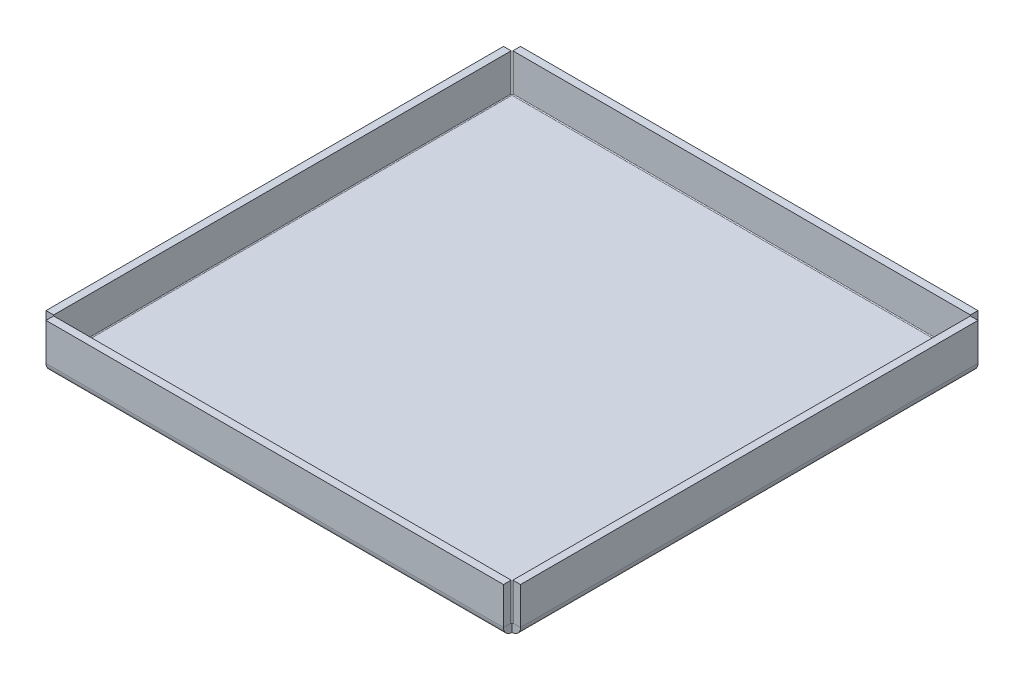
ISO-10303-21;
HEADER;
FILE_DESCRIPTION(('STEP AP214'),'2;1');
FILE_NAME('part.step','',(''),(''),'','','');
FILE_SCHEMA(('AUTOMOTIVE_DESIGN { 1 0 10303 214 1 1 1 1 }'));
ENDSEC;
DATA;
#1=APPLICATION_CONTEXT('core data for automotive mechanical design processes');
#2=APPLICATION_PROTOCOL_DEFINITION('international standard','automotive_design',2000,#1);
#3=PRODUCT_CONTEXT('',#1,'mechanical');
#4=PRODUCT('Part','Part','',(#3));
#5=PRODUCT_RELATED_PRODUCT_CATEGORY('part','',(#4));
#6=PRODUCT_DEFINITION_FORMATION('','',#4);
#7=PRODUCT_DEFINITION_CONTEXT('part definition',#1,'design');
#8=PRODUCT_DEFINITION('design','',#6,#7);
#9=PRODUCT_DEFINITION_SHAPE('','',#8);
#10=(LENGTH_UNIT() NAMED_UNIT(*) SI_UNIT(.MILLI.,.METRE.));
#11=(NAMED_UNIT(*) PLANE_ANGLE_UNIT() SI_UNIT($,.RADIAN.));
#12=(NAMED_UNIT(*) SI_UNIT($,.STERADIAN.) SOLID_ANGLE_UNIT());
#13=UNCERTAINTY_MEASURE_WITH_UNIT(LENGTH_MEASURE(1.E-05),#10,'distance_accuracy_value','');
#14=(GEOMETRIC_REPRESENTATION_CONTEXT(3) GLOBAL_UNCERTAINTY_ASSIGNED_CONTEXT((#13)) GLOBAL_UNIT_ASSIGNED_CONTEXT((#10,
#11,#12)) REPRESENTATION_CONTEXT('',''));
#15=CARTESIAN_POINT('',(0.,0.,0.));
#16=DIRECTION('',(0.,0.,1.));
#17=DIRECTION('',(1.,0.,0.));
#18=AXIS2_PLACEMENT_3D('',#15,#16,#17);
#19=CARTESIAN_POINT('',(0.,-6.35,0.));
#20=DIRECTION('',(0.,-1.,0.));
#21=DIRECTION('',(0.,0.,-1.));
#22=AXIS2_PLACEMENT_3D('',#19,#20,#21);
#23=PLANE('',#22);
#24=DIRECTION('',(0.,0.,1.));
#25=VECTOR('',#24,1.);
#26=CARTESIAN_POINT('',(0.,-6.35,0.));
#27=LINE('',#26,#25);
#28=CARTESIAN_POINT('',(0.,-6.35,-381.));
#29=VERTEX_POINT('',#28);
#30=CARTESIAN_POINT('',(-1.20653222897863E-13,-6.34999999999999,0.));
#31=VERTEX_POINT('',#30);
#32=EDGE_CURVE('E434',#29,#31,#27,.T.);
#33=ORIENTED_EDGE('',*,*,#32,.F.);
#34=DIRECTION('',(-1.,0.,0.));
#35=VECTOR('',#34,1.);
#36=CARTESIAN_POINT('',(0.,-6.35,-381.));
#37=LINE('',#36,#35);
#38=CARTESIAN_POINT('',(381.,-6.35,-381.));
#39=VERTEX_POINT('',#38);
#40=EDGE_CURVE('E443',#39,#29,#37,.T.);
#41=ORIENTED_EDGE('',*,*,#40,.F.);
#42=DIRECTION('',(0.,0.,-1.));
#43=VECTOR('',#42,1.);
#44=CARTESIAN_POINT('',(381.,-6.35,0.));
#45=LINE('',#44,#43);
#46=CARTESIAN_POINT('',(381.,-6.35000000000001,-1.20816556676851E-13));
#47=VERTEX_POINT('',#46);
#48=EDGE_CURVE('E440',#47,#39,#45,.T.);
#49=ORIENTED_EDGE('',*,*,#48,.F.);
#50=DIRECTION('',(1.,0.,0.));
#51=VECTOR('',#50,1.);
#52=CARTESIAN_POINT('',(0.,-6.35,0.));
#53=LINE('',#52,#51);
#54=EDGE_CURVE('E437',#31,#47,#53,.T.);
#55=ORIENTED_EDGE('',*,*,#54,.F.);
#56=EDGE_LOOP('',(#33,#41,#49,#55));
#57=FACE_BOUND('',#56,.T.);
#58=ADVANCED_FACE('F117',(#57),#23,.T.);
#59=CARTESIAN_POINT('',(0.,0.,0.));
#60=DIRECTION('',(0.,-1.,0.));
#61=DIRECTION('',(0.,0.,-1.));
#62=AXIS2_PLACEMENT_3D('',#59,#60,#61);
#63=PLANE('',#62);
#64=DIRECTION('',(0.,0.,1.));
#65=VECTOR('',#64,1.);
#66=CARTESIAN_POINT('',(0.,0.,0.));
#67=LINE('',#66,#65);
#68=CARTESIAN_POINT('',(0.,0.,-381.));
#69=VERTEX_POINT('',#68);
#70=CARTESIAN_POINT('',(0.,0.,0.));
#71=VERTEX_POINT('',#70);
#72=EDGE_CURVE('E425',#69,#71,#67,.T.);
#73=ORIENTED_EDGE('',*,*,#72,.T.);
#74=DIRECTION('',(1.,0.,0.));
#75=VECTOR('',#74,1.);
#76=CARTESIAN_POINT('',(0.,0.,0.));
#77=LINE('',#76,#75);
#78=CARTESIAN_POINT('',(381.,0.,0.));
#79=VERTEX_POINT('',#78);
#80=EDGE_CURVE('E447',#71,#79,#77,.T.);
#81=ORIENTED_EDGE('',*,*,#80,.T.);
#82=DIRECTION('',(0.,0.,-1.));
#83=VECTOR('',#82,1.);
#84=CARTESIAN_POINT('',(381.,0.,0.));
#85=LINE('',#84,#83);
#86=CARTESIAN_POINT('',(381.,0.,-381.));
#87=VERTEX_POINT('',#86);
#88=EDGE_CURVE('E139',#79,#87,#85,.T.);
#89=ORIENTED_EDGE('',*,*,#88,.T.);
#90=DIRECTION('',(-1.,0.,0.));
#91=VECTOR('',#90,1.);
#92=CARTESIAN_POINT('',(0.,0.,-381.));
#93=LINE('',#92,#91);
#94=EDGE_CURVE('E134',#87,#69,#93,.T.);
#95=ORIENTED_EDGE('',*,*,#94,.T.);
#96=EDGE_LOOP('',(#73,#81,#89,#95));
#97=FACE_BOUND('',#96,.T.);
#98=ADVANCED_FACE('F119',(#97),#63,.F.);
#99=CARTESIAN_POINT('',(0.,0.7366,-381.));
#100=DIRECTION('',(0.,0.,-1.));
#101=DIRECTION('',(-1.,0.,0.));
#102=AXIS2_PLACEMENT_3D('',#99,#100,#101);
#103=PLANE('',#102);
#104=DIRECTION('',(1.,0.,0.));
#105=VECTOR('',#104,1.);
#106=CARTESIAN_POINT('',(-7.0866,0.736599999999975,-381.));
#107=LINE('',#106,#105);
#108=CARTESIAN_POINT('',(-0.7366,0.736599999999997,-381.));
#109=VERTEX_POINT('',#108);
#110=CARTESIAN_POINT('',(-7.0866,0.736599999999975,-381.));
#111=VERTEX_POINT('',#110);
#112=EDGE_CURVE('E383',#109,#111,#107,.F.);
#113=ORIENTED_EDGE('',*,*,#112,.F.);
#114=CARTESIAN_POINT('',(0.,0.7366,-381.));
#115=DIRECTION('',(0.,0.,1.));
#116=DIRECTION('',(1.,0.,0.));
#117=AXIS2_PLACEMENT_3D('',#114,#115,#116);
#118=CIRCLE('',#117,0.736599999999986);
#119=EDGE_CURVE('E429',#69,#109,#118,.F.);
#120=ORIENTED_EDGE('',*,*,#119,.F.);
#121=DIRECTION('',(0.,1.,0.));
#122=VECTOR('',#121,1.);
#123=CARTESIAN_POINT('',(0.,-6.35,-381.));
#124=LINE('',#123,#122);
#125=EDGE_CURVE('E13',#29,#69,#124,.T.);
#126=ORIENTED_EDGE('',*,*,#125,.F.);
#127=CARTESIAN_POINT('',(0.,0.7366,-381.));
#128=DIRECTION('',(0.,0.,1.));
#129=DIRECTION('',(1.,0.,0.));
#130=AXIS2_PLACEMENT_3D('',#127,#128,#129);
#131=CIRCLE('',#130,7.08659999999999);
#132=EDGE_CURVE('E422',#29,#111,#131,.F.);
#133=ORIENTED_EDGE('',*,*,#132,.T.);
#134=EDGE_LOOP('',(#113,#120,#126,#133));
#135=FACE_BOUND('',#134,.T.);
#136=ADVANCED_FACE('F512',(#135),#103,.T.);
#137=CARTESIAN_POINT('',(0.,0.7366,0.));
#138=DIRECTION('',(0.,0.,-1.));
#139=DIRECTION('',(-1.,0.,0.));
#140=AXIS2_PLACEMENT_3D('',#137,#138,#139);
#141=PLANE('',#140);
#142=CARTESIAN_POINT('',(0.,0.7366,0.));
#143=DIRECTION('',(0.,0.,1.));
#144=DIRECTION('',(1.,0.,0.));
#145=AXIS2_PLACEMENT_3D('',#142,#143,#144);
#146=CIRCLE('',#145,0.736599999999986);
#147=CARTESIAN_POINT('',(-0.736599999999972,0.736599999999997,0.));
#148=VERTEX_POINT('',#147);
#149=EDGE_CURVE('E395',#148,#71,#146,.T.);
#150=ORIENTED_EDGE('',*,*,#149,.F.);
#151=DIRECTION('',(1.,0.,0.));
#152=VECTOR('',#151,1.);
#153=CARTESIAN_POINT('',(-0.7366,0.736599999999997,0.));
#154=LINE('',#153,#152);
#155=CARTESIAN_POINT('',(-7.0866,0.736599999999975,0.));
#156=VERTEX_POINT('',#155);
#157=EDGE_CURVE('E415',#148,#156,#154,.F.);
#158=ORIENTED_EDGE('',*,*,#157,.T.);
#159=CARTESIAN_POINT('',(0.,0.7366,0.));
#160=DIRECTION('',(0.,0.,1.));
#161=DIRECTION('',(1.,0.,0.));
#162=AXIS2_PLACEMENT_3D('',#159,#160,#161);
#163=CIRCLE('',#162,7.08659999999999);
#164=EDGE_CURVE('E426',#156,#31,#163,.T.);
#165=ORIENTED_EDGE('',*,*,#164,.T.);
#166=DIRECTION('',(0.,1.,0.));
#167=VECTOR('',#166,1.);
#168=CARTESIAN_POINT('',(0.,-6.35,0.));
#169=LINE('',#168,#167);
#170=EDGE_CURVE('E121',#31,#71,#169,.T.);
#171=ORIENTED_EDGE('',*,*,#170,.T.);
#172=EDGE_LOOP('',(#150,#158,#165,#171));
#173=FACE_BOUND('',#172,.T.);
#174=ADVANCED_FACE('F461',(#173),#141,.F.);
#175=CARTESIAN_POINT('',(0.,0.7366,0.));
#176=DIRECTION('',(0.,0.,1.));
#177=DIRECTION('',(-1.,0.,0.));
#178=AXIS2_PLACEMENT_3D('',#175,#176,#177);
#179=CYLINDRICAL_SURFACE('',#178,7.08659999999999);
#180=ORIENTED_EDGE('',*,*,#32,.T.);
#181=ORIENTED_EDGE('',*,*,#164,.F.);
#182=DIRECTION('',(0.,0.,1.));
#183=VECTOR('',#182,1.);
#184=CARTESIAN_POINT('',(-7.0866,0.736599999999975,-381.));
#185=LINE('',#184,#183);
#186=EDGE_CURVE('E413',#156,#111,#185,.F.);
#187=ORIENTED_EDGE('',*,*,#186,.T.);
#188=ORIENTED_EDGE('',*,*,#132,.F.);
#189=EDGE_LOOP('',(#180,#181,#187,#188));
#190=FACE_BOUND('',#189,.T.);
#191=ADVANCED_FACE('F517',(#190),#179,.T.);
#192=CARTESIAN_POINT('',(0.,0.7366,0.));
#193=DIRECTION('',(0.,0.,1.));
#194=DIRECTION('',(-1.,0.,0.));
#195=AXIS2_PLACEMENT_3D('',#192,#193,#194);
#196=CYLINDRICAL_SURFACE('',#195,0.736599999999986);
#197=ORIENTED_EDGE('',*,*,#72,.F.);
#198=ORIENTED_EDGE('',*,*,#119,.T.);
#199=DIRECTION('',(0.,0.,1.));
#200=VECTOR('',#199,1.);
#201=CARTESIAN_POINT('',(-0.7366,0.736599999999997,-381.));
#202=LINE('',#201,#200);
#203=EDGE_CURVE('E418',#109,#148,#202,.T.);
#204=ORIENTED_EDGE('',*,*,#203,.T.);
#205=ORIENTED_EDGE('',*,*,#149,.T.);
#206=EDGE_LOOP('',(#197,#198,#204,#205));
#207=FACE_BOUND('',#206,.T.);
#208=ADVANCED_FACE('F468',(#207),#196,.F.);
#209=CARTESIAN_POINT('',(-7.08660000000011,31.75,0.));
#210=DIRECTION('',(0.,0.,-1.));
#211=DIRECTION('',(-1.,0.,0.));
#212=AXIS2_PLACEMENT_3D('',#209,#210,#211);
#213=PLANE('',#212);
#214=ORIENTED_EDGE('',*,*,#157,.F.);
#215=DIRECTION('',(0.,-1.,0.));
#216=VECTOR('',#215,1.);
#217=CARTESIAN_POINT('',(-0.736600000000108,31.75,0.));
#218=LINE('',#217,#216);
#219=CARTESIAN_POINT('',(-0.736600000000108,31.75,0.));
#220=VERTEX_POINT('',#219);
#221=EDGE_CURVE('E411',#148,#220,#218,.F.);
#222=ORIENTED_EDGE('',*,*,#221,.T.);
#223=DIRECTION('',(1.,0.,0.));
#224=VECTOR('',#223,1.);
#225=CARTESIAN_POINT('',(-7.08660000000011,31.75,0.));
#226=LINE('',#225,#224);
#227=CARTESIAN_POINT('',(-7.08660000000011,31.75,0.));
#228=VERTEX_POINT('',#227);
#229=EDGE_CURVE('E392',#228,#220,#226,.T.);
#230=ORIENTED_EDGE('',*,*,#229,.F.);
#231=DIRECTION('',(0.,1.,0.));
#232=VECTOR('',#231,1.);
#233=CARTESIAN_POINT('',(-7.0866,0.,0.));
#234=LINE('',#233,#232);
#235=EDGE_CURVE('E404',#156,#228,#234,.T.);
#236=ORIENTED_EDGE('',*,*,#235,.F.);
#237=EDGE_LOOP('',(#214,#222,#230,#236));
#238=FACE_BOUND('',#237,.T.);
#239=ADVANCED_FACE('F523',(#238),#213,.F.);
#240=CARTESIAN_POINT('',(-7.0866,0.,-381.));
#241=DIRECTION('',(0.,0.,1.));
#242=DIRECTION('',(1.,0.,0.));
#243=AXIS2_PLACEMENT_3D('',#240,#241,#242);
#244=PLANE('',#243);
#245=ORIENTED_EDGE('',*,*,#112,.T.);
#246=DIRECTION('',(0.,-1.,0.));
#247=VECTOR('',#246,1.);
#248=CARTESIAN_POINT('',(-7.0866,0.,-381.));
#249=LINE('',#248,#247);
#250=CARTESIAN_POINT('',(-7.08660000000011,31.75,-381.));
#251=VERTEX_POINT('',#250);
#252=EDGE_CURVE('E399',#251,#111,#249,.T.);
#253=ORIENTED_EDGE('',*,*,#252,.F.);
#254=DIRECTION('',(1.,0.,0.));
#255=VECTOR('',#254,1.);
#256=CARTESIAN_POINT('',(-7.08660000000011,31.75,-381.));
#257=LINE('',#256,#255);
#258=CARTESIAN_POINT('',(-0.736600000000108,31.75,-381.));
#259=VERTEX_POINT('',#258);
#260=EDGE_CURVE('E396',#251,#259,#257,.T.);
#261=ORIENTED_EDGE('',*,*,#260,.T.);
#262=DIRECTION('',(0.,1.,0.));
#263=VECTOR('',#262,1.);
#264=CARTESIAN_POINT('',(-0.736599999999997,0.,-381.));
#265=LINE('',#264,#263);
#266=EDGE_CURVE('E406',#259,#109,#265,.F.);
#267=ORIENTED_EDGE('',*,*,#266,.T.);
#268=EDGE_LOOP('',(#245,#253,#261,#267));
#269=FACE_BOUND('',#268,.T.);
#270=ADVANCED_FACE('F529',(#269),#244,.F.);
#271=CARTESIAN_POINT('',(-7.0866,0.,0.));
#272=DIRECTION('',(1.,0.,0.));
#273=DIRECTION('',(0.,1.,0.));
#274=AXIS2_PLACEMENT_3D('',#271,#272,#273);
#275=PLANE('',#274);
#276=ORIENTED_EDGE('',*,*,#186,.F.);
#277=ORIENTED_EDGE('',*,*,#235,.T.);
#278=DIRECTION('',(0.,0.,-1.));
#279=VECTOR('',#278,1.);
#280=CARTESIAN_POINT('',(-7.08660000000011,31.75,0.));
#281=LINE('',#280,#279);
#282=EDGE_CURVE('E402',#228,#251,#281,.T.);
#283=ORIENTED_EDGE('',*,*,#282,.T.);
#284=ORIENTED_EDGE('',*,*,#252,.T.);
#285=EDGE_LOOP('',(#276,#277,#283,#284));
#286=FACE_BOUND('',#285,.T.);
#287=ADVANCED_FACE('F539',(#286),#275,.F.);
#288=CARTESIAN_POINT('',(-0.736599999999997,0.,0.));
#289=DIRECTION('',(1.,0.,0.));
#290=DIRECTION('',(0.,1.,0.));
#291=AXIS2_PLACEMENT_3D('',#288,#289,#290);
#292=PLANE('',#291);
#293=ORIENTED_EDGE('',*,*,#221,.F.);
#294=ORIENTED_EDGE('',*,*,#203,.F.);
#295=ORIENTED_EDGE('',*,*,#266,.F.);
#296=DIRECTION('',(0.,0.,1.));
#297=VECTOR('',#296,1.);
#298=CARTESIAN_POINT('',(-0.736600000000108,31.75,-381.));
#299=LINE('',#298,#297);
#300=EDGE_CURVE('E409',#220,#259,#299,.F.);
#301=ORIENTED_EDGE('',*,*,#300,.F.);
#302=EDGE_LOOP('',(#293,#294,#295,#301));
#303=FACE_BOUND('',#302,.T.);
#304=ADVANCED_FACE('F535',(#303),#292,.T.);
#305=CARTESIAN_POINT('',(-7.08660000000011,31.75,-381.));
#306=DIRECTION('',(0.,-1.,0.));
#307=DIRECTION('',(1.,0.,0.));
#308=AXIS2_PLACEMENT_3D('',#305,#306,#307);
#309=PLANE('',#308);
#310=ORIENTED_EDGE('',*,*,#300,.T.);
#311=ORIENTED_EDGE('',*,*,#260,.F.);
#312=ORIENTED_EDGE('',*,*,#282,.F.);
#313=ORIENTED_EDGE('',*,*,#229,.T.);
#314=EDGE_LOOP('',(#310,#311,#312,#313));
#315=FACE_BOUND('',#314,.T.);
#316=ADVANCED_FACE('F531',(#315),#309,.F.);
#317=CARTESIAN_POINT('',(381.,0.736599999999971,-381.));
#318=DIRECTION('',(1.,0.,0.));
#319=DIRECTION('',(0.,0.,-1.));
#320=AXIS2_PLACEMENT_3D('',#317,#318,#319);
#321=PLANE('',#320);
#322=DIRECTION('',(0.,0.,1.));
#323=VECTOR('',#322,1.);
#324=CARTESIAN_POINT('',(381.,0.73660000000002,-388.0866));
#325=LINE('',#324,#323);
#326=CARTESIAN_POINT('',(381.,0.736599999999969,-381.7366));
#327=VERTEX_POINT('',#326);
#328=CARTESIAN_POINT('',(381.,0.736599999999946,-388.0866));
#329=VERTEX_POINT('',#328);
#330=EDGE_CURVE('E341',#327,#329,#325,.F.);
#331=ORIENTED_EDGE('',*,*,#330,.F.);
#332=CARTESIAN_POINT('',(381.,0.736599999999971,-381.));
#333=DIRECTION('',(-1.,0.,0.));
#334=DIRECTION('',(0.,0.,1.));
#335=AXIS2_PLACEMENT_3D('',#332,#333,#334);
#336=CIRCLE('',#335,0.736599999999976);
#337=EDGE_CURVE('E387',#87,#327,#336,.F.);
#338=ORIENTED_EDGE('',*,*,#337,.F.);
#339=DIRECTION('',(0.,1.,0.));
#340=VECTOR('',#339,1.);
#341=CARTESIAN_POINT('',(381.,-6.35,-381.));
#342=LINE('',#341,#340);
#343=EDGE_CURVE('E126',#39,#87,#342,.T.);
#344=ORIENTED_EDGE('',*,*,#343,.F.);
#345=CARTESIAN_POINT('',(381.,0.736599999999971,-381.));
#346=DIRECTION('',(-1.,0.,0.));
#347=DIRECTION('',(0.,0.,1.));
#348=AXIS2_PLACEMENT_3D('',#345,#346,#347);
#349=CIRCLE('',#348,7.08659999999998);
#350=EDGE_CURVE('E380',#39,#329,#349,.F.);
#351=ORIENTED_EDGE('',*,*,#350,.T.);
#352=EDGE_LOOP('',(#331,#338,#344,#351));
#353=FACE_BOUND('',#352,.T.);
#354=ADVANCED_FACE('F534',(#353),#321,.T.);
#355=CARTESIAN_POINT('',(0.,0.736599999999971,-381.));
#356=DIRECTION('',(1.,0.,0.));
#357=DIRECTION('',(0.,0.,-1.));
#358=AXIS2_PLACEMENT_3D('',#355,#356,#357);
#359=PLANE('',#358);
#360=CARTESIAN_POINT('',(0.,0.736599999999971,-381.));
#361=DIRECTION('',(-1.,0.,0.));
#362=DIRECTION('',(0.,0.,1.));
#363=AXIS2_PLACEMENT_3D('',#360,#361,#362);
#364=CIRCLE('',#363,0.736599999999976);
#365=CARTESIAN_POINT('',(0.,0.736599999999969,-381.7366));
#366=VERTEX_POINT('',#365);
#367=EDGE_CURVE('E353',#366,#69,#364,.T.);
#368=ORIENTED_EDGE('',*,*,#367,.F.);
#369=DIRECTION('',(0.,0.,1.));
#370=VECTOR('',#369,1.);
#371=CARTESIAN_POINT('',(0.,0.736599999999976,-381.7366));
#372=LINE('',#371,#370);
#373=CARTESIAN_POINT('',(0.,0.73660000000002,-388.0866));
#374=VERTEX_POINT('',#373);
#375=EDGE_CURVE('E373',#366,#374,#372,.F.);
#376=ORIENTED_EDGE('',*,*,#375,.T.);
#377=CARTESIAN_POINT('',(0.,0.736599999999971,-381.));
#378=DIRECTION('',(-1.,0.,0.));
#379=DIRECTION('',(0.,0.,1.));
#380=AXIS2_PLACEMENT_3D('',#377,#378,#379);
#381=CIRCLE('',#380,7.08659999999998);
#382=EDGE_CURVE('E384',#374,#29,#381,.T.);
#383=ORIENTED_EDGE('',*,*,#382,.T.);
#384=ORIENTED_EDGE('',*,*,#125,.T.);
#385=EDGE_LOOP('',(#368,#376,#383,#384));
#386=FACE_BOUND('',#385,.T.);
#387=ADVANCED_FACE('F547',(#386),#359,.F.);
#388=CARTESIAN_POINT('',(0.,0.736599999999971,-381.));
#389=DIRECTION('',(-1.,0.,0.));
#390=DIRECTION('',(0.,0.,-1.));
#391=AXIS2_PLACEMENT_3D('',#388,#389,#390);
#392=CYLINDRICAL_SURFACE('',#391,7.08659999999998);
#393=ORIENTED_EDGE('',*,*,#40,.T.);
#394=ORIENTED_EDGE('',*,*,#382,.F.);
#395=DIRECTION('',(-1.,0.,0.));
#396=VECTOR('',#395,1.);
#397=CARTESIAN_POINT('',(381.,0.73660000000002,-388.0866));
#398=LINE('',#397,#396);
#399=EDGE_CURVE('E371',#374,#329,#398,.F.);
#400=ORIENTED_EDGE('',*,*,#399,.T.);
#401=ORIENTED_EDGE('',*,*,#350,.F.);
#402=EDGE_LOOP('',(#393,#394,#400,#401));
#403=FACE_BOUND('',#402,.T.);
#404=ADVANCED_FACE('F550',(#403),#392,.T.);
#405=CARTESIAN_POINT('',(0.,0.736599999999971,-381.));
#406=DIRECTION('',(-1.,0.,0.));
#407=DIRECTION('',(0.,0.,-1.));
#408=AXIS2_PLACEMENT_3D('',#405,#406,#407);
#409=CYLINDRICAL_SURFACE('',#408,0.736599999999976);
#410=ORIENTED_EDGE('',*,*,#94,.F.);
#411=ORIENTED_EDGE('',*,*,#337,.T.);
#412=DIRECTION('',(-1.,0.,0.));
#413=VECTOR('',#412,1.);
#414=CARTESIAN_POINT('',(381.,0.736599999999976,-381.7366));
#415=LINE('',#414,#413);
#416=EDGE_CURVE('E376',#327,#366,#415,.T.);
#417=ORIENTED_EDGE('',*,*,#416,.T.);
#418=ORIENTED_EDGE('',*,*,#367,.T.);
#419=EDGE_LOOP('',(#410,#411,#417,#418));
#420=FACE_BOUND('',#419,.T.);
#421=ADVANCED_FACE('F555',(#420),#409,.F.);
#422=CARTESIAN_POINT('',(0.,31.75,-388.0866));
#423=DIRECTION('',(1.,0.,0.));
#424=DIRECTION('',(0.,0.,-1.));
#425=AXIS2_PLACEMENT_3D('',#422,#423,#424);
#426=PLANE('',#425);
#427=ORIENTED_EDGE('',*,*,#375,.F.);
#428=DIRECTION('',(0.,-1.,0.));
#429=VECTOR('',#428,1.);
#430=CARTESIAN_POINT('',(0.,31.75,-381.7366));
#431=LINE('',#430,#429);
#432=CARTESIAN_POINT('',(0.,31.75,-381.7366));
#433=VERTEX_POINT('',#432);
#434=EDGE_CURVE('E369',#366,#433,#431,.F.);
#435=ORIENTED_EDGE('',*,*,#434,.T.);
#436=DIRECTION('',(0.,0.,1.));
#437=VECTOR('',#436,1.);
#438=CARTESIAN_POINT('',(0.,31.75,-388.0866));
#439=LINE('',#438,#437);
#440=CARTESIAN_POINT('',(0.,31.75,-388.0866));
#441=VERTEX_POINT('',#440);
#442=EDGE_CURVE('E350',#441,#433,#439,.T.);
#443=ORIENTED_EDGE('',*,*,#442,.F.);
#444=DIRECTION('',(0.,1.,0.));
#445=VECTOR('',#444,1.);
#446=CARTESIAN_POINT('',(0.,-1.35443853605184E-12,-388.0866));
#447=LINE('',#446,#445);
#448=EDGE_CURVE('E362',#374,#441,#447,.T.);
#449=ORIENTED_EDGE('',*,*,#448,.F.);
#450=EDGE_LOOP('',(#427,#435,#443,#449));
#451=FACE_BOUND('',#450,.T.);
#452=ADVANCED_FACE('F558',(#451),#426,.F.);
#453=CARTESIAN_POINT('',(381.,0.,-388.0866));
#454=DIRECTION('',(-1.,0.,0.));
#455=DIRECTION('',(0.,0.,1.));
#456=AXIS2_PLACEMENT_3D('',#453,#454,#455);
#457=PLANE('',#456);
#458=ORIENTED_EDGE('',*,*,#330,.T.);
#459=DIRECTION('',(0.,-1.,0.));
#460=VECTOR('',#459,1.);
#461=CARTESIAN_POINT('',(381.,-1.35443853605184E-12,-388.0866));
#462=LINE('',#461,#460);
#463=CARTESIAN_POINT('',(381.,31.75,-388.0866));
#464=VERTEX_POINT('',#463);
#465=EDGE_CURVE('E357',#464,#329,#462,.T.);
#466=ORIENTED_EDGE('',*,*,#465,.F.);
#467=DIRECTION('',(0.,0.,1.));
#468=VECTOR('',#467,1.);
#469=CARTESIAN_POINT('',(381.,31.75,-388.0866));
#470=LINE('',#469,#468);
#471=CARTESIAN_POINT('',(381.,31.75,-381.7366));
#472=VERTEX_POINT('',#471);
#473=EDGE_CURVE('E354',#464,#472,#470,.T.);
#474=ORIENTED_EDGE('',*,*,#473,.T.);
#475=DIRECTION('',(0.,1.,0.));
#476=VECTOR('',#475,1.);
#477=CARTESIAN_POINT('',(381.,0.,-381.7366));
#478=LINE('',#477,#476);
#479=EDGE_CURVE('E364',#472,#327,#478,.F.);
#480=ORIENTED_EDGE('',*,*,#479,.T.);
#481=EDGE_LOOP('',(#458,#466,#474,#480));
#482=FACE_BOUND('',#481,.T.);
#483=ADVANCED_FACE('F565',(#482),#457,.F.);
#484=CARTESIAN_POINT('',(0.,-1.35443853605184E-12,-388.0866));
#485=DIRECTION('',(0.,0.,1.));
#486=DIRECTION('',(0.,-1.,0.));
#487=AXIS2_PLACEMENT_3D('',#484,#485,#486);
#488=PLANE('',#487);
#489=ORIENTED_EDGE('',*,*,#399,.F.);
#490=ORIENTED_EDGE('',*,*,#448,.T.);
#491=DIRECTION('',(1.,0.,0.));
#492=VECTOR('',#491,1.);
#493=CARTESIAN_POINT('',(0.,31.75,-388.0866));
#494=LINE('',#493,#492);
#495=EDGE_CURVE('E360',#441,#464,#494,.T.);
#496=ORIENTED_EDGE('',*,*,#495,.T.);
#497=ORIENTED_EDGE('',*,*,#465,.T.);
#498=EDGE_LOOP('',(#489,#490,#496,#497));
#499=FACE_BOUND('',#498,.T.);
#500=ADVANCED_FACE('F574',(#499),#488,.F.);
#501=CARTESIAN_POINT('',(0.,-1.33226762955019E-12,-381.7366));
#502=DIRECTION('',(0.,0.,1.));
#503=DIRECTION('',(0.,-1.,0.));
#504=AXIS2_PLACEMENT_3D('',#501,#502,#503);
#505=PLANE('',#504);
#506=ORIENTED_EDGE('',*,*,#434,.F.);
#507=ORIENTED_EDGE('',*,*,#416,.F.);
#508=ORIENTED_EDGE('',*,*,#479,.F.);
#509=DIRECTION('',(-1.,0.,0.));
#510=VECTOR('',#509,1.);
#511=CARTESIAN_POINT('',(381.,31.75,-381.7366));
#512=LINE('',#511,#510);
#513=EDGE_CURVE('E367',#433,#472,#512,.F.);
#514=ORIENTED_EDGE('',*,*,#513,.F.);
#515=EDGE_LOOP('',(#506,#507,#508,#514));
#516=FACE_BOUND('',#515,.T.);
#517=ADVANCED_FACE('F570',(#516),#505,.T.);
#518=CARTESIAN_POINT('',(381.,31.75,-388.0866));
#519=DIRECTION('',(0.,-1.,0.));
#520=DIRECTION('',(0.,0.,-1.));
#521=AXIS2_PLACEMENT_3D('',#518,#519,#520);
#522=PLANE('',#521);
#523=ORIENTED_EDGE('',*,*,#513,.T.);
#524=ORIENTED_EDGE('',*,*,#473,.F.);
#525=ORIENTED_EDGE('',*,*,#495,.F.);
#526=ORIENTED_EDGE('',*,*,#442,.T.);
#527=EDGE_LOOP('',(#523,#524,#525,#526));
#528=FACE_BOUND('',#527,.T.);
#529=ADVANCED_FACE('F567',(#528),#522,.F.);
#530=CARTESIAN_POINT('',(0.,0.736599999999997,0.));
#531=DIRECTION('',(-1.,0.,0.));
#532=DIRECTION('',(0.,0.,1.));
#533=AXIS2_PLACEMENT_3D('',#530,#531,#532);
#534=PLANE('',#533);
#535=DIRECTION('',(0.,0.,-1.));
#536=VECTOR('',#535,1.);
#537=CARTESIAN_POINT('',(0.,0.736599999999997,7.0866));
#538=LINE('',#537,#536);
#539=CARTESIAN_POINT('',(0.,0.736599999999997,0.736599999999997));
#540=VERTEX_POINT('',#539);
#541=CARTESIAN_POINT('',(0.,0.736599999999997,7.0866));
#542=VERTEX_POINT('',#541);
#543=EDGE_CURVE('E298',#540,#542,#538,.F.);
#544=ORIENTED_EDGE('',*,*,#543,.F.);
#545=CARTESIAN_POINT('',(0.,0.736599999999997,0.));
#546=DIRECTION('',(1.,0.,0.));
#547=DIRECTION('',(0.,0.,-1.));
#548=AXIS2_PLACEMENT_3D('',#545,#546,#547);
#549=CIRCLE('',#548,0.736600000000011);
#550=EDGE_CURVE('E345',#71,#540,#549,.F.);
#551=ORIENTED_EDGE('',*,*,#550,.F.);
#552=ORIENTED_EDGE('',*,*,#170,.F.);
#553=CARTESIAN_POINT('',(0.,0.736599999999997,0.));
#554=DIRECTION('',(1.,0.,0.));
#555=DIRECTION('',(0.,0.,-1.));
#556=AXIS2_PLACEMENT_3D('',#553,#554,#555);
#557=CIRCLE('',#556,7.08660000000001);
#558=EDGE_CURVE('E338',#31,#542,#557,.F.);
#559=ORIENTED_EDGE('',*,*,#558,.T.);
#560=EDGE_LOOP('',(#544,#551,#552,#559));
#561=FACE_BOUND('',#560,.T.);
#562=ADVANCED_FACE('F474',(#561),#534,.T.);
#563=CARTESIAN_POINT('',(381.,0.736599999999997,0.));
#564=DIRECTION('',(-1.,0.,0.));
#565=DIRECTION('',(0.,0.,1.));
#566=AXIS2_PLACEMENT_3D('',#563,#564,#565);
#567=PLANE('',#566);
#568=CARTESIAN_POINT('',(381.,0.736599999999997,0.));
#569=DIRECTION('',(1.,0.,0.));
#570=DIRECTION('',(0.,0.,-1.));
#571=AXIS2_PLACEMENT_3D('',#568,#569,#570);
#572=CIRCLE('',#571,0.736600000000011);
#573=CARTESIAN_POINT('',(381.,0.736599999999997,0.736600000000025));
#574=VERTEX_POINT('',#573);
#575=EDGE_CURVE('E311',#574,#79,#572,.T.);
#576=ORIENTED_EDGE('',*,*,#575,.F.);
#577=DIRECTION('',(0.,0.,-1.));
#578=VECTOR('',#577,1.);
#579=CARTESIAN_POINT('',(381.,0.736599999999997,0.7366));
#580=LINE('',#579,#578);
#581=CARTESIAN_POINT('',(381.,0.736599999999997,7.0866));
#582=VERTEX_POINT('',#581);
#583=EDGE_CURVE('E331',#574,#582,#580,.F.);
#584=ORIENTED_EDGE('',*,*,#583,.T.);
#585=CARTESIAN_POINT('',(381.,0.736599999999997,0.));
#586=DIRECTION('',(1.,0.,0.));
#587=DIRECTION('',(0.,0.,-1.));
#588=AXIS2_PLACEMENT_3D('',#585,#586,#587);
#589=CIRCLE('',#588,7.08660000000001);
#590=EDGE_CURVE('E342',#582,#47,#589,.T.);
#591=ORIENTED_EDGE('',*,*,#590,.T.);
#592=DIRECTION('',(0.,1.,0.));
#593=VECTOR('',#592,1.);
#594=CARTESIAN_POINT('',(381.,-6.35,0.));
#595=LINE('',#594,#593);
#596=EDGE_CURVE('E452',#47,#79,#595,.T.);
#597=ORIENTED_EDGE('',*,*,#596,.T.);
#598=EDGE_LOOP('',(#576,#584,#591,#597));
#599=FACE_BOUND('',#598,.T.);
#600=ADVANCED_FACE('F493',(#599),#567,.F.);
#601=CARTESIAN_POINT('',(381.,0.736599999999997,0.));
#602=DIRECTION('',(1.,0.,0.));
#603=DIRECTION('',(0.,0.,1.));
#604=AXIS2_PLACEMENT_3D('',#601,#602,#603);
#605=CYLINDRICAL_SURFACE('',#604,7.08660000000001);
#606=ORIENTED_EDGE('',*,*,#54,.T.);
#607=ORIENTED_EDGE('',*,*,#590,.F.);
#608=DIRECTION('',(1.,0.,0.));
#609=VECTOR('',#608,1.);
#610=CARTESIAN_POINT('',(0.,0.736599999999997,7.0866));
#611=LINE('',#610,#609);
#612=EDGE_CURVE('E329',#582,#542,#611,.F.);
#613=ORIENTED_EDGE('',*,*,#612,.T.);
#614=ORIENTED_EDGE('',*,*,#558,.F.);
#615=EDGE_LOOP('',(#606,#607,#613,#614));
#616=FACE_BOUND('',#615,.T.);
#617=ADVANCED_FACE('F503',(#616),#605,.T.);
#618=CARTESIAN_POINT('',(381.,0.736599999999997,0.));
#619=DIRECTION('',(1.,0.,0.));
#620=DIRECTION('',(0.,0.,1.));
#621=AXIS2_PLACEMENT_3D('',#618,#619,#620);
#622=CYLINDRICAL_SURFACE('',#621,0.736600000000011);
#623=ORIENTED_EDGE('',*,*,#80,.F.);
#624=ORIENTED_EDGE('',*,*,#550,.T.);
#625=DIRECTION('',(1.,0.,0.));
#626=VECTOR('',#625,1.);
#627=CARTESIAN_POINT('',(0.,0.736599999999997,0.736599999999997));
#628=LINE('',#627,#626);
#629=EDGE_CURVE('E334',#540,#574,#628,.T.);
#630=ORIENTED_EDGE('',*,*,#629,.T.);
#631=ORIENTED_EDGE('',*,*,#575,.T.);
#632=EDGE_LOOP('',(#623,#624,#630,#631));
#633=FACE_BOUND('',#632,.T.);
#634=ADVANCED_FACE('F472',(#633),#622,.F.);
#635=CARTESIAN_POINT('',(381.,31.75,7.0866));
#636=DIRECTION('',(-1.,0.,0.));
#637=DIRECTION('',(0.,0.,1.));
#638=AXIS2_PLACEMENT_3D('',#635,#636,#637);
#639=PLANE('',#638);
#640=ORIENTED_EDGE('',*,*,#583,.F.);
#641=DIRECTION('',(0.,-1.,0.));
#642=VECTOR('',#641,1.);
#643=CARTESIAN_POINT('',(381.,31.75,0.736599999999997));
#644=LINE('',#643,#642);
#645=CARTESIAN_POINT('',(381.,31.75,0.736599999999997));
#646=VERTEX_POINT('',#645);
#647=EDGE_CURVE('E327',#574,#646,#644,.F.);
#648=ORIENTED_EDGE('',*,*,#647,.T.);
#649=DIRECTION('',(0.,0.,-1.));
#650=VECTOR('',#649,1.);
#651=CARTESIAN_POINT('',(381.,31.75,7.0866));
#652=LINE('',#651,#650);
#653=CARTESIAN_POINT('',(381.,31.75,7.0866));
#654=VERTEX_POINT('',#653);
#655=EDGE_CURVE('E308',#654,#646,#652,.T.);
#656=ORIENTED_EDGE('',*,*,#655,.F.);
#657=DIRECTION('',(0.,1.,0.));
#658=VECTOR('',#657,1.);
#659=CARTESIAN_POINT('',(381.,0.,7.0866));
#660=LINE('',#659,#658);
#661=EDGE_CURVE('E320',#582,#654,#660,.T.);
#662=ORIENTED_EDGE('',*,*,#661,.F.);
#663=EDGE_LOOP('',(#640,#648,#656,#662));
#664=FACE_BOUND('',#663,.T.);
#665=ADVANCED_FACE('F495',(#664),#639,.F.);
#666=CARTESIAN_POINT('',(0.,0.,7.0866));
#667=DIRECTION('',(1.,0.,0.));
#668=DIRECTION('',(0.,0.,-1.));
#669=AXIS2_PLACEMENT_3D('',#666,#667,#668);
#670=PLANE('',#669);
#671=ORIENTED_EDGE('',*,*,#543,.T.);
#672=DIRECTION('',(0.,-1.,0.));
#673=VECTOR('',#672,1.);
#674=CARTESIAN_POINT('',(0.,0.,7.0866));
#675=LINE('',#674,#673);
#676=CARTESIAN_POINT('',(0.,31.75,7.0866));
#677=VERTEX_POINT('',#676);
#678=EDGE_CURVE('E315',#677,#542,#675,.T.);
#679=ORIENTED_EDGE('',*,*,#678,.F.);
#680=DIRECTION('',(0.,0.,-1.));
#681=VECTOR('',#680,1.);
#682=CARTESIAN_POINT('',(0.,31.75,7.0866));
#683=LINE('',#682,#681);
#684=CARTESIAN_POINT('',(0.,31.75,0.736599999999997));
#685=VERTEX_POINT('',#684);
#686=EDGE_CURVE('E312',#677,#685,#683,.T.);
#687=ORIENTED_EDGE('',*,*,#686,.T.);
#688=DIRECTION('',(0.,1.,0.));
#689=VECTOR('',#688,1.);
#690=CARTESIAN_POINT('',(0.,0.,0.736599999999997));
#691=LINE('',#690,#689);
#692=EDGE_CURVE('E322',#685,#540,#691,.F.);
#693=ORIENTED_EDGE('',*,*,#692,.T.);
#694=EDGE_LOOP('',(#671,#679,#687,#693));
#695=FACE_BOUND('',#694,.T.);
#696=ADVANCED_FACE('F477',(#695),#670,.F.);
#697=CARTESIAN_POINT('',(0.,0.,7.0866));
#698=DIRECTION('',(0.,0.,-1.));
#699=DIRECTION('',(-1.,0.,0.));
#700=AXIS2_PLACEMENT_3D('',#697,#698,#699);
#701=PLANE('',#700);
#702=ORIENTED_EDGE('',*,*,#612,.F.);
#703=ORIENTED_EDGE('',*,*,#661,.T.);
#704=DIRECTION('',(-1.,0.,0.));
#705=VECTOR('',#704,1.);
#706=CARTESIAN_POINT('',(0.,31.75,7.0866));
#707=LINE('',#706,#705);
#708=EDGE_CURVE('E318',#654,#677,#707,.T.);
#709=ORIENTED_EDGE('',*,*,#708,.T.);
#710=ORIENTED_EDGE('',*,*,#678,.T.);
#711=EDGE_LOOP('',(#702,#703,#709,#710));
#712=FACE_BOUND('',#711,.T.);
#713=ADVANCED_FACE('F481',(#712),#701,.F.);
#714=CARTESIAN_POINT('',(0.,0.,0.736599999999997));
#715=DIRECTION('',(0.,0.,-1.));
#716=DIRECTION('',(-1.,0.,0.));
#717=AXIS2_PLACEMENT_3D('',#714,#715,#716);
#718=PLANE('',#717);
#719=ORIENTED_EDGE('',*,*,#647,.F.);
#720=ORIENTED_EDGE('',*,*,#629,.F.);
#721=ORIENTED_EDGE('',*,*,#692,.F.);
#722=DIRECTION('',(1.,0.,0.));
#723=VECTOR('',#722,1.);
#724=CARTESIAN_POINT('',(0.,31.75,0.736599999999997));
#725=LINE('',#724,#723);
#726=EDGE_CURVE('E325',#646,#685,#725,.F.);
#727=ORIENTED_EDGE('',*,*,#726,.F.);
#728=EDGE_LOOP('',(#719,#720,#721,#727));
#729=FACE_BOUND('',#728,.T.);
#730=ADVANCED_FACE('F491',(#729),#718,.T.);
#731=CARTESIAN_POINT('',(0.,31.75,7.0866));
#732=DIRECTION('',(0.,-1.,0.));
#733=DIRECTION('',(0.,0.,-1.));
#734=AXIS2_PLACEMENT_3D('',#731,#732,#733);
#735=PLANE('',#734);
#736=ORIENTED_EDGE('',*,*,#726,.T.);
#737=ORIENTED_EDGE('',*,*,#686,.F.);
#738=ORIENTED_EDGE('',*,*,#708,.F.);
#739=ORIENTED_EDGE('',*,*,#655,.T.);
#740=EDGE_LOOP('',(#736,#737,#738,#739));
#741=FACE_BOUND('',#740,.T.);
#742=ADVANCED_FACE('F487',(#741),#735,.F.);
#743=CARTESIAN_POINT('',(381.,0.736599999999979,0.));
#744=DIRECTION('',(0.,0.,1.));
#745=DIRECTION('',(1.,0.,0.));
#746=AXIS2_PLACEMENT_3D('',#743,#744,#745);
#747=PLANE('',#746);
#748=DIRECTION('',(-1.,0.,0.));
#749=VECTOR('',#748,1.);
#750=CARTESIAN_POINT('',(388.0866,0.736599999999954,0.));
#751=LINE('',#750,#749);
#752=CARTESIAN_POINT('',(381.7366,0.736599999999976,0.));
#753=VERTEX_POINT('',#752);
#754=CARTESIAN_POINT('',(388.0866,0.736599999999954,0.));
#755=VERTEX_POINT('',#754);
#756=EDGE_CURVE('E278',#753,#755,#751,.F.);
#757=ORIENTED_EDGE('',*,*,#756,.F.);
#758=CARTESIAN_POINT('',(381.,0.736599999999979,0.));
#759=DIRECTION('',(0.,0.,-1.));
#760=DIRECTION('',(-1.,0.,0.));
#761=AXIS2_PLACEMENT_3D('',#758,#759,#760);
#762=CIRCLE('',#761,0.736599999999976);
#763=EDGE_CURVE('E302',#79,#753,#762,.F.);
#764=ORIENTED_EDGE('',*,*,#763,.F.);
#765=ORIENTED_EDGE('',*,*,#596,.F.);
#766=CARTESIAN_POINT('',(381.,0.736599999999979,0.));
#767=DIRECTION('',(0.,0.,-1.));
#768=DIRECTION('',(-1.,0.,0.));
#769=AXIS2_PLACEMENT_3D('',#766,#767,#768);
#770=CIRCLE('',#769,7.08659999999998);
#771=EDGE_CURVE('E295',#47,#755,#770,.F.);
#772=ORIENTED_EDGE('',*,*,#771,.T.);
#773=EDGE_LOOP('',(#757,#764,#765,#772));
#774=FACE_BOUND('',#773,.T.);
#775=ADVANCED_FACE('F592',(#774),#747,.T.);
#776=CARTESIAN_POINT('',(381.,0.736599999999979,-381.));
#777=DIRECTION('',(0.,0.,1.));
#778=DIRECTION('',(1.,0.,0.));
#779=AXIS2_PLACEMENT_3D('',#776,#777,#778);
#780=PLANE('',#779);
#781=CARTESIAN_POINT('',(381.,0.736599999999979,-381.));
#782=DIRECTION('',(0.,0.,-1.));
#783=DIRECTION('',(-1.,0.,0.));
#784=AXIS2_PLACEMENT_3D('',#781,#782,#783);
#785=CIRCLE('',#784,0.736599999999976);
#786=CARTESIAN_POINT('',(381.7366,0.736599999999976,-381.));
#787=VERTEX_POINT('',#786);
#788=EDGE_CURVE('E305',#787,#87,#785,.T.);
#789=ORIENTED_EDGE('',*,*,#788,.F.);
#790=DIRECTION('',(-1.,0.,0.));
#791=VECTOR('',#790,1.);
#792=CARTESIAN_POINT('',(381.7366,0.736599999999976,-381.));
#793=LINE('',#792,#791);
#794=CARTESIAN_POINT('',(388.0866,0.736599999999954,-381.));
#795=VERTEX_POINT('',#794);
#796=EDGE_CURVE('E289',#787,#795,#793,.F.);
#797=ORIENTED_EDGE('',*,*,#796,.T.);
#798=CARTESIAN_POINT('',(381.,0.736599999999979,-381.));
#799=DIRECTION('',(0.,0.,-1.));
#800=DIRECTION('',(-1.,0.,0.));
#801=AXIS2_PLACEMENT_3D('',#798,#799,#800);
#802=CIRCLE('',#801,7.08659999999998);
#803=EDGE_CURVE('E299',#795,#39,#802,.T.);
#804=ORIENTED_EDGE('',*,*,#803,.T.);
#805=ORIENTED_EDGE('',*,*,#343,.T.);
#806=EDGE_LOOP('',(#789,#797,#804,#805));
#807=FACE_BOUND('',#806,.T.);
#808=ADVANCED_FACE('F607',(#807),#780,.F.);
#809=CARTESIAN_POINT('',(381.,0.736599999999979,-381.));
#810=DIRECTION('',(0.,0.,-1.));
#811=DIRECTION('',(1.,0.,0.));
#812=AXIS2_PLACEMENT_3D('',#809,#810,#811);
#813=CYLINDRICAL_SURFACE('',#812,7.08659999999998);
#814=ORIENTED_EDGE('',*,*,#48,.T.);
#815=ORIENTED_EDGE('',*,*,#803,.F.);
#816=DIRECTION('',(0.,0.,-1.));
#817=VECTOR('',#816,1.);
#818=CARTESIAN_POINT('',(388.0866,0.736599999999954,0.));
#819=LINE('',#818,#817);
#820=EDGE_CURVE('E287',#795,#755,#819,.F.);
#821=ORIENTED_EDGE('',*,*,#820,.T.);
#822=ORIENTED_EDGE('',*,*,#771,.F.);
#823=EDGE_LOOP('',(#814,#815,#821,#822));
#824=FACE_BOUND('',#823,.T.);
#825=ADVANCED_FACE('F594',(#824),#813,.T.);
#826=CARTESIAN_POINT('',(381.,0.736599999999979,-381.));
#827=DIRECTION('',(0.,0.,-1.));
#828=DIRECTION('',(1.,0.,0.));
#829=AXIS2_PLACEMENT_3D('',#826,#827,#828);
#830=CYLINDRICAL_SURFACE('',#829,0.736599999999976);
#831=ORIENTED_EDGE('',*,*,#88,.F.);
#832=ORIENTED_EDGE('',*,*,#763,.T.);
#833=DIRECTION('',(0.,0.,-1.));
#834=VECTOR('',#833,1.);
#835=CARTESIAN_POINT('',(381.7366,0.736599999999976,0.));
#836=LINE('',#835,#834);
#837=EDGE_CURVE('E292',#753,#787,#836,.T.);
#838=ORIENTED_EDGE('',*,*,#837,.T.);
#839=ORIENTED_EDGE('',*,*,#788,.T.);
#840=EDGE_LOOP('',(#831,#832,#838,#839));
#841=FACE_BOUND('',#840,.T.);
#842=ADVANCED_FACE('F605',(#841),#830,.F.);
#843=CARTESIAN_POINT('',(388.0866,0.,0.));
#844=DIRECTION('',(0.,0.,-1.));
#845=DIRECTION('',(-1.,0.,0.));
#846=AXIS2_PLACEMENT_3D('',#843,#844,#845);
#847=PLANE('',#846);
#848=ORIENTED_EDGE('',*,*,#756,.T.);
#849=DIRECTION('',(0.,-1.,0.));
#850=VECTOR('',#849,1.);
#851=CARTESIAN_POINT('',(388.0866,-1.35443853605184E-12,0.));
#852=LINE('',#851,#850);
#853=CARTESIAN_POINT('',(388.0866,31.75,0.));
#854=VERTEX_POINT('',#853);
#855=EDGE_CURVE('E259',#854,#755,#852,.T.);
#856=ORIENTED_EDGE('',*,*,#855,.F.);
#857=DIRECTION('',(-1.,0.,0.));
#858=VECTOR('',#857,1.);
#859=CARTESIAN_POINT('',(388.0866,31.75,0.));
#860=LINE('',#859,#858);
#861=CARTESIAN_POINT('',(381.7366,31.75,0.));
#862=VERTEX_POINT('',#861);
#863=EDGE_CURVE('E265',#854,#862,#860,.T.);
#864=ORIENTED_EDGE('',*,*,#863,.T.);
#865=DIRECTION('',(0.,1.,0.));
#866=VECTOR('',#865,1.);
#867=CARTESIAN_POINT('',(381.7366,0.,0.));
#868=LINE('',#867,#866);
#869=EDGE_CURVE('E285',#862,#753,#868,.F.);
#870=ORIENTED_EDGE('',*,*,#869,.T.);
#871=EDGE_LOOP('',(#848,#856,#864,#870));
#872=FACE_BOUND('',#871,.T.);
#873=ADVANCED_FACE('F277',(#872),#847,.F.);
#874=CARTESIAN_POINT('',(388.0866,31.75,-381.));
#875=DIRECTION('',(0.,0.,1.));
#876=DIRECTION('',(1.,0.,0.));
#877=AXIS2_PLACEMENT_3D('',#874,#875,#876);
#878=PLANE('',#877);
#879=ORIENTED_EDGE('',*,*,#796,.F.);
#880=DIRECTION('',(0.,-1.,0.));
#881=VECTOR('',#880,1.);
#882=CARTESIAN_POINT('',(381.7366,31.75,-381.));
#883=LINE('',#882,#881);
#884=CARTESIAN_POINT('',(381.7366,31.75,-381.));
#885=VERTEX_POINT('',#884);
#886=EDGE_CURVE('E281',#787,#885,#883,.F.);
#887=ORIENTED_EDGE('',*,*,#886,.T.);
#888=DIRECTION('',(-1.,0.,0.));
#889=VECTOR('',#888,1.);
#890=CARTESIAN_POINT('',(388.0866,31.75,-381.));
#891=LINE('',#890,#889);
#892=CARTESIAN_POINT('',(388.0866,31.75,-381.));
#893=VERTEX_POINT('',#892);
#894=EDGE_CURVE('E274',#893,#885,#891,.T.);
#895=ORIENTED_EDGE('',*,*,#894,.F.);
#896=DIRECTION('',(0.,1.,0.));
#897=VECTOR('',#896,1.);
#898=CARTESIAN_POINT('',(388.0866,-1.35443853605184E-12,-381.));
#899=LINE('',#898,#897);
#900=EDGE_CURVE('E261',#795,#893,#899,.T.);
#901=ORIENTED_EDGE('',*,*,#900,.F.);
#902=EDGE_LOOP('',(#879,#887,#895,#901));
#903=FACE_BOUND('',#902,.T.);
#904=ADVANCED_FACE('F597',(#903),#878,.F.);
#905=CARTESIAN_POINT('',(388.0866,-1.35443853605184E-12,0.));
#906=DIRECTION('',(-1.,0.,0.));
#907=DIRECTION('',(0.,-1.,0.));
#908=AXIS2_PLACEMENT_3D('',#905,#906,#907);
#909=PLANE('',#908);
#910=ORIENTED_EDGE('',*,*,#820,.F.);
#911=ORIENTED_EDGE('',*,*,#900,.T.);
#912=DIRECTION('',(0.,0.,1.));
#913=VECTOR('',#912,1.);
#914=CARTESIAN_POINT('',(388.0866,31.75,0.));
#915=LINE('',#914,#913);
#916=EDGE_CURVE('E254',#893,#854,#915,.T.);
#917=ORIENTED_EDGE('',*,*,#916,.T.);
#918=ORIENTED_EDGE('',*,*,#855,.T.);
#919=EDGE_LOOP('',(#910,#911,#917,#918));
#920=FACE_BOUND('',#919,.T.);
#921=ADVANCED_FACE('F257',(#920),#909,.F.);
#922=CARTESIAN_POINT('',(381.7366,-1.33226762955019E-12,0.));
#923=DIRECTION('',(-1.,0.,0.));
#924=DIRECTION('',(0.,-1.,0.));
#925=AXIS2_PLACEMENT_3D('',#922,#923,#924);
#926=PLANE('',#925);
#927=ORIENTED_EDGE('',*,*,#886,.F.);
#928=ORIENTED_EDGE('',*,*,#837,.F.);
#929=ORIENTED_EDGE('',*,*,#869,.F.);
#930=DIRECTION('',(0.,0.,-1.));
#931=VECTOR('',#930,1.);
#932=CARTESIAN_POINT('',(381.7366,31.75,0.));
#933=LINE('',#932,#931);
#934=EDGE_CURVE('E270',#885,#862,#933,.F.);
#935=ORIENTED_EDGE('',*,*,#934,.F.);
#936=EDGE_LOOP('',(#927,#928,#929,#935));
#937=FACE_BOUND('',#936,.T.);
#938=ADVANCED_FACE('F601',(#937),#926,.T.);
#939=CARTESIAN_POINT('',(388.0866,31.75,0.));
#940=DIRECTION('',(0.,-1.,0.));
#941=DIRECTION('',(1.,0.,0.));
#942=AXIS2_PLACEMENT_3D('',#939,#940,#941);
#943=PLANE('',#942);
#944=ORIENTED_EDGE('',*,*,#934,.T.);
#945=ORIENTED_EDGE('',*,*,#863,.F.);
#946=ORIENTED_EDGE('',*,*,#916,.F.);
#947=ORIENTED_EDGE('',*,*,#894,.T.);
#948=EDGE_LOOP('',(#944,#945,#946,#947));
#949=FACE_BOUND('',#948,.T.);
#950=ADVANCED_FACE('F268',(#949),#943,.F.);
#951=CLOSED_SHELL('',(#58,#98,#136,#174,#191,#208,#239,#270,#287,#304,#316,#354,#387,#404,#421,
#452,#483,#500,#517,#529,#562,#600,#617,#634,#665,#696,#713,#730,#742,#775,#808,#825,#842,#873,
#904,#921,#938,#950));
#952=MANIFOLD_SOLID_BREP('B2',#951);
#953=ADVANCED_BREP_SHAPE_REPRESENTATION('',(#18,#952),#14);
#954=SHAPE_DEFINITION_REPRESENTATION(#9,#953);
ENDSEC;
END-ISO-10303-21;
